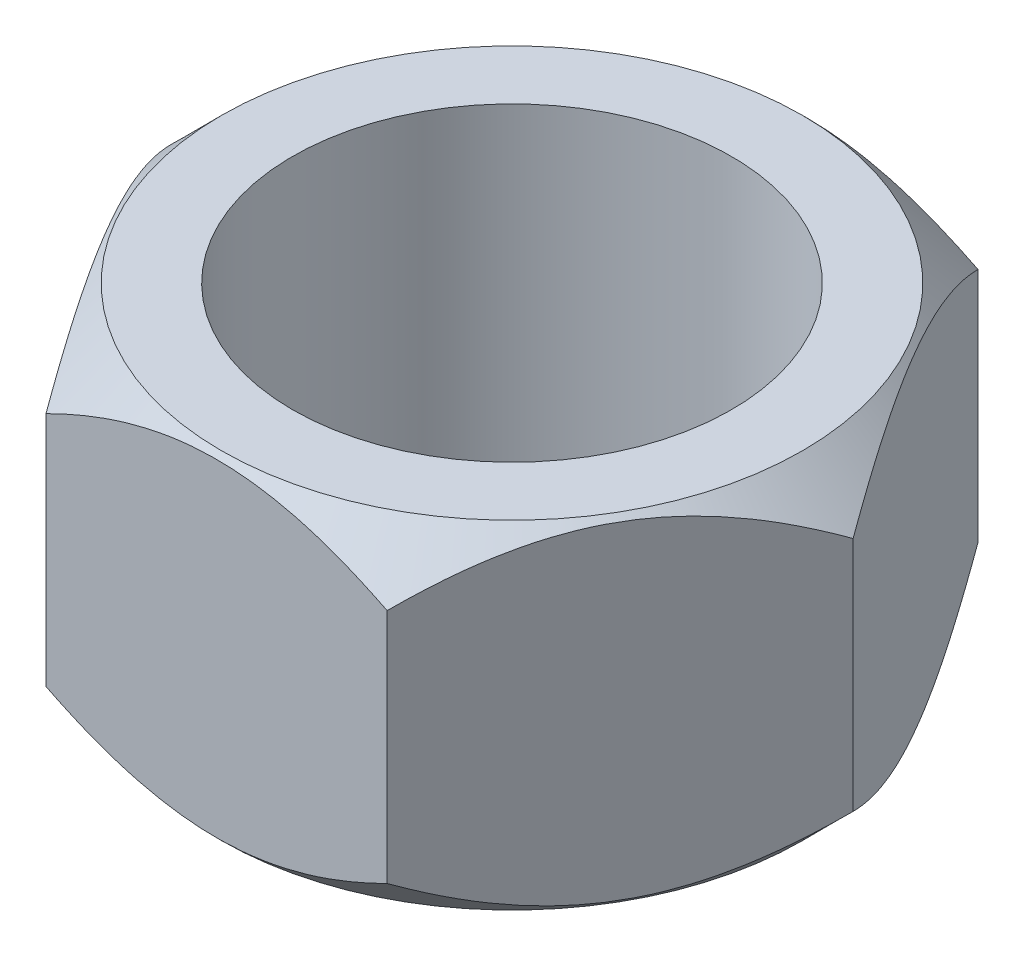
ISO-10303-21;
HEADER;
FILE_DESCRIPTION(('STEP AP214'),'2;1');
FILE_NAME('part.step','',(''),(''),'','','');
FILE_SCHEMA(('AUTOMOTIVE_DESIGN { 1 0 10303 214 1 1 1 1 }'));
ENDSEC;
DATA;
#1=APPLICATION_CONTEXT('core data for automotive mechanical design processes');
#2=APPLICATION_PROTOCOL_DEFINITION('international standard','automotive_design',2000,#1);
#3=PRODUCT_CONTEXT('',#1,'mechanical');
#4=PRODUCT('Part','Part','',(#3));
#5=PRODUCT_RELATED_PRODUCT_CATEGORY('part','',(#4));
#6=PRODUCT_DEFINITION_FORMATION('','',#4);
#7=PRODUCT_DEFINITION_CONTEXT('part definition',#1,'design');
#8=PRODUCT_DEFINITION('design','',#6,#7);
#9=PRODUCT_DEFINITION_SHAPE('','',#8);
#10=(LENGTH_UNIT() NAMED_UNIT(*) SI_UNIT(.MILLI.,.METRE.));
#11=(NAMED_UNIT(*) PLANE_ANGLE_UNIT() SI_UNIT($,.RADIAN.));
#12=(NAMED_UNIT(*) SI_UNIT($,.STERADIAN.) SOLID_ANGLE_UNIT());
#13=UNCERTAINTY_MEASURE_WITH_UNIT(LENGTH_MEASURE(1.E-05),#10,'distance_accuracy_value','');
#14=(GEOMETRIC_REPRESENTATION_CONTEXT(3) GLOBAL_UNCERTAINTY_ASSIGNED_CONTEXT((#13)) GLOBAL_UNIT_ASSIGNED_CONTEXT((#10,
#11,#12)) REPRESENTATION_CONTEXT('',''));
#15=CARTESIAN_POINT('',(0.,0.,0.));
#16=DIRECTION('',(0.,0.,1.));
#17=DIRECTION('',(1.,0.,0.));
#18=AXIS2_PLACEMENT_3D('',#15,#16,#17);
#19=CARTESIAN_POINT('',(0.,0.2,0.));
#20=DIRECTION('',(0.,1.,0.));
#21=DIRECTION('',(0.,0.,1.));
#22=AXIS2_PLACEMENT_3D('',#19,#20,#21);
#23=PLANE('',#22);
#24=CARTESIAN_POINT('',(0.,0.2,0.));
#25=DIRECTION('',(0.,1.,0.));
#26=DIRECTION('',(0.,0.,1.));
#27=AXIS2_PLACEMENT_3D('',#24,#25,#26);
#28=CIRCLE('',#27,0.13);
#29=CARTESIAN_POINT('',(0.,0.2,0.13));
#30=VERTEX_POINT('',#29);
#31=EDGE_CURVE('E126',#30,#30,#28,.T.);
#32=ORIENTED_EDGE('',*,*,#31,.F.);
#33=EDGE_LOOP('',(#32));
#34=FACE_BOUND('',#33,.T.);
#35=CARTESIAN_POINT('',(0.,0.2,0.));
#36=DIRECTION('',(0.,-1.,0.));
#37=DIRECTION('',(0.,0.,-1.));
#38=AXIS2_PLACEMENT_3D('',#35,#36,#37);
#39=CIRCLE('',#38,0.172072594216369);
#40=CARTESIAN_POINT('',(0.,0.2,-0.172072594216369));
#41=VERTEX_POINT('',#40);
#42=EDGE_CURVE('E222',#41,#41,#39,.T.);
#43=ORIENTED_EDGE('',*,*,#42,.F.);
#44=EDGE_LOOP('',(#43));
#45=FACE_BOUND('',#44,.T.);
#46=ADVANCED_FACE('F39',(#34,#45),#23,.T.);
#47=CARTESIAN_POINT('',(0.,0.,0.));
#48=DIRECTION('',(0.,1.,0.));
#49=DIRECTION('',(0.,0.,1.));
#50=AXIS2_PLACEMENT_3D('',#47,#48,#49);
#51=PLANE('',#50);
#52=CARTESIAN_POINT('',(0.,0.,0.));
#53=DIRECTION('',(0.,1.,0.));
#54=DIRECTION('',(0.,0.,1.));
#55=AXIS2_PLACEMENT_3D('',#52,#53,#54);
#56=CIRCLE('',#55,0.13);
#57=CARTESIAN_POINT('',(0.,0.,0.13));
#58=VERTEX_POINT('',#57);
#59=EDGE_CURVE('E123',#58,#58,#56,.F.);
#60=ORIENTED_EDGE('',*,*,#59,.F.);
#61=EDGE_LOOP('',(#60));
#62=FACE_BOUND('',#61,.T.);
#63=CARTESIAN_POINT('',(0.,0.,0.));
#64=DIRECTION('',(0.,-1.,0.));
#65=DIRECTION('',(0.,0.,-1.));
#66=AXIS2_PLACEMENT_3D('',#63,#64,#65);
#67=CIRCLE('',#66,0.172072594216369);
#68=CARTESIAN_POINT('',(0.,0.,-0.172072594216369));
#69=VERTEX_POINT('',#68);
#70=EDGE_CURVE('E219',#69,#69,#67,.T.);
#71=ORIENTED_EDGE('',*,*,#70,.T.);
#72=EDGE_LOOP('',(#71));
#73=FACE_BOUND('',#72,.T.);
#74=ADVANCED_FACE('F237',(#62,#73),#51,.F.);
#75=CARTESIAN_POINT('',(0.,-0.000999999999999997,0.));
#76=DIRECTION('',(0.,1.,0.));
#77=DIRECTION('',(0.,0.,1.));
#78=AXIS2_PLACEMENT_3D('',#75,#76,#77);
#79=CYLINDRICAL_SURFACE('',#78,0.13);
#80=ORIENTED_EDGE('',*,*,#31,.T.);
#81=EDGE_LOOP('',(#80));
#82=FACE_BOUND('',#81,.T.);
#83=ORIENTED_EDGE('',*,*,#59,.T.);
#84=EDGE_LOOP('',(#83));
#85=FACE_BOUND('',#84,.T.);
#86=ADVANCED_FACE('F151',(#82,#85),#79,.F.);
#87=CARTESIAN_POINT('',(0.,0.03,0.));
#88=DIRECTION('',(0.,1.,0.));
#89=DIRECTION('',(0.,0.,1.));
#90=AXIS2_PLACEMENT_3D('',#87,#88,#89);
#91=CONICAL_SURFACE('',#90,0.202072594216369,0.785398163397448);
#92=ORIENTED_EDGE('',*,*,#70,.F.);
#93=EDGE_LOOP('',(#92));
#94=FACE_BOUND('',#93,.T.);
#95=CARTESIAN_POINT('',(-0.305523676388778,0.180020741185078,0.175000000000003));
#96=CARTESIAN_POINT('',(-0.296489908838127,0.172183831382914,0.175000000000003));
#97=CARTESIAN_POINT('',(-0.287415146295133,0.164392967909618,0.175000000000003));
#98=CARTESIAN_POINT('',(-0.269154387743841,0.148934007099864,0.175000000000003));
#99=CARTESIAN_POINT('',(-0.259968341025767,0.141265969735403,0.175000000000003));
#100=CARTESIAN_POINT('',(-0.231792912014465,0.118159352301111,0.175000000000002));
#101=CARTESIAN_POINT('',(-0.212593498149153,0.102976933592517,0.175000000000002));
#102=CARTESIAN_POINT('',(-0.173225826261023,0.0737968112831864,0.175000000000002));
#103=CARTESIAN_POINT('',(-0.153056247455226,0.0598007987664813,0.175000000000002));
#104=CARTESIAN_POINT('',(-0.121625871967722,0.0408846564593255,0.175000000000001));
#105=CARTESIAN_POINT('',(-0.110992522327468,0.0349428850748385,0.175000000000001));
#106=CARTESIAN_POINT('',(-0.0892065324424278,0.0241236116347812,0.175000000000001));
#107=CARTESIAN_POINT('',(-0.0780548914239576,0.019244157012983,0.175000000000001));
#108=CARTESIAN_POINT('',(-0.054889353290563,0.0110090414325916,0.175000000000001));
#109=CARTESIAN_POINT('',(-0.042861810598884,0.00768961095311468,0.175));
#110=CARTESIAN_POINT('',(-0.0184374809922947,0.00349261265701018,0.175));
#111=CARTESIAN_POINT('',(-0.00604375843554487,0.00259860561394281,0.175));
#112=CARTESIAN_POINT('',(0.0186589035579463,0.00348347437230432,0.175));
#113=CARTESIAN_POINT('',(0.0309676778388264,0.00526658114702027,0.175));
#114=CARTESIAN_POINT('',(0.055121835537638,0.0110204288976895,0.174999999999999));
#115=CARTESIAN_POINT('',(0.066962891236474,0.0150080075104535,0.174999999999999));
#116=CARTESIAN_POINT('',(0.0925903967170636,0.0254913127781551,0.174999999999999));
#117=CARTESIAN_POINT('',(0.106222397963112,0.0323479327338906,0.174999999999999));
#118=CARTESIAN_POINT('',(0.132785083008031,0.0473282769905635,0.174999999999999));
#119=CARTESIAN_POINT('',(0.145713884757198,0.0554551958902634,0.174999999999998));
#120=CARTESIAN_POINT('',(0.171116757407903,0.0725030550642843,0.174999999999998));
#121=CARTESIAN_POINT('',(0.183588422373839,0.0814275266529352,0.174999999999998));
#122=CARTESIAN_POINT('',(0.208171534529215,0.0997613344596472,0.174999999999998));
#123=CARTESIAN_POINT('',(0.220282872493368,0.109170815382806,0.174999999999998));
#124=CARTESIAN_POINT('',(0.244773267048624,0.128729600372015,0.174999999999997));
#125=CARTESIAN_POINT('',(0.257140782569694,0.138893253718197,0.174999999999997));
#126=CARTESIAN_POINT('',(0.281533947754556,0.15935584068324,0.174999999999997));
#127=CARTESIAN_POINT('',(0.293561858362563,0.169652072271718,0.174999999999997));
#128=CARTESIAN_POINT('',(0.305523676388796,0.180020741185059,0.174999999999997));
#129=B_SPLINE_CURVE_WITH_KNOTS('',3,(#95,#96,#97,#98,#99,#100,#101,#102,#103,#104,#105,#106,
#107,#108,#109,#110,#111,#112,#113,#114,#115,#116,#117,#118,#119,#120,#121,#122,#123,#124,#125,
#126,#127,#128),.UNSPECIFIED.,.F.,.F.,(4,2,2,2,2,2,2,2,2,2,2,2,2,2,2,2,4),(0.,
0.0358791858717531,0.0717753868661952,0.145194810618015,0.218717184603454,0.255222439137126,
0.291660018720837,0.328906459590413,0.365899810358559,0.402951687859047,0.440290555644729,
0.485949579311969,0.531725332469436,0.577714888588238,0.623718246264905,0.671738421373987,
0.71923249865855),.UNSPECIFIED.);
#130=CARTESIAN_POINT('',(-0.101036297108183,0.03,0.175000000000001));
#131=VERTEX_POINT('',#130);
#132=CARTESIAN_POINT('',(0.101036297108187,0.03,0.174999999999999));
#133=VERTEX_POINT('',#132);
#134=EDGE_CURVE('E216',#131,#133,#129,.T.);
#135=ORIENTED_EDGE('',*,*,#134,.F.);
#136=CARTESIAN_POINT('',(-0.202188064270207,0.0301155689716211,-0.000199999999998585));
#137=CARTESIAN_POINT('',(-0.198703631032227,0.0266353582002987,0.00583521540376361));
#138=CARTESIAN_POINT('',(-0.19516812884351,0.0233561607693212,0.0119588848248932));
#139=CARTESIAN_POINT('',(-0.187958416249236,0.0173509339832806,0.024446473346144));
#140=CARTESIAN_POINT('',(-0.184283514126903,0.0146282605899538,0.030811590534868));
#141=CARTESIAN_POINT('',(-0.173197940686131,0.00767257771140506,0.0500123669653207));
#142=CARTESIAN_POINT('',(-0.165595169610615,0.00450719433873056,0.0631807527464294));
#143=CARTESIAN_POINT('',(-0.152438981682354,0.00259198694259939,0.0859679386721011));
#144=CARTESIAN_POINT('',(-0.146921716381356,0.00283778648731017,0.0955241224922663));
#145=CARTESIAN_POINT('',(-0.135999962652701,0.0053380333682639,0.114441154858052));
#146=CARTESIAN_POINT('',(-0.130595655856693,0.00759549393812453,0.123801688808426));
#147=CARTESIAN_POINT('',(-0.121088664876771,0.0130527175286838,0.140268280212751));
#148=CARTESIAN_POINT('',(-0.1169428139788,0.0159716193201152,0.14744910460864));
#149=CARTESIAN_POINT('',(-0.108814120659484,0.0225492282802671,0.161528414436842));
#150=CARTESIAN_POINT('',(-0.104830798271256,0.0262055337725978,0.168427731196179));
#151=CARTESIAN_POINT('',(-0.100920827054125,0.0301155689700877,0.175200000000383));
#152=B_SPLINE_CURVE_WITH_KNOTS('',3,(#136,#137,#138,#139,#140,#141,#142,#143,#144,#145,#146,
#147,#148,#149,#150,#151),.UNSPECIFIED.,.F.,.F.,(4,2,2,2,2,2,2,4),(0.,0.0233618368538911,
0.046860644775359,0.0929709001337304,0.125885794260102,0.158850074087303,0.185183994279812,
0.211433492833065),.UNSPECIFIED.);
#153=CARTESIAN_POINT('',(-0.202072594216369,0.03,0.));
#154=VERTEX_POINT('',#153);
#155=EDGE_CURVE('E218',#154,#131,#152,.T.);
#156=ORIENTED_EDGE('',*,*,#155,.F.);
#157=CARTESIAN_POINT('',(-0.100920827054347,0.0301155689716211,-0.1752));
#158=CARTESIAN_POINT('',(-0.104405260292327,0.0266353582002988,-0.169164784596237));
#159=CARTESIAN_POINT('',(-0.107940762481044,0.0233561607693213,-0.163041115175108));
#160=CARTESIAN_POINT('',(-0.115150475075318,0.0173509339832807,-0.150553526653857));
#161=CARTESIAN_POINT('',(-0.118825377197651,0.0146282605899538,-0.144188409465133));
#162=CARTESIAN_POINT('',(-0.129910950638423,0.00767257771140508,-0.12498763303468));
#163=CARTESIAN_POINT('',(-0.137513721713939,0.00450719433873059,-0.111819247253571));
#164=CARTESIAN_POINT('',(-0.150669909642199,0.00259198694259939,-0.0890320613278992));
#165=CARTESIAN_POINT('',(-0.156187174943197,0.00283778648731015,-0.0794758775077339));
#166=CARTESIAN_POINT('',(-0.167108928671852,0.00533803336826387,-0.0605588451419479));
#167=CARTESIAN_POINT('',(-0.172513235467859,0.00759549393812453,-0.0511983111915738));
#168=CARTESIAN_POINT('',(-0.182020226447782,0.0130527175286838,-0.0347317197872485));
#169=CARTESIAN_POINT('',(-0.186166077345752,0.0159716193201152,-0.0275508953913593));
#170=CARTESIAN_POINT('',(-0.194294770665068,0.022549228280267,-0.0134715855631578));
#171=CARTESIAN_POINT('',(-0.198278093053296,0.0262055337725977,-0.00657226880382017));
#172=CARTESIAN_POINT('',(-0.202188064270427,0.0301155689700877,0.000200000000382929));
#173=B_SPLINE_CURVE_WITH_KNOTS('',3,(#157,#158,#159,#160,#161,#162,#163,#164,#165,#166,#167,
#168,#169,#170,#171,#172),.UNSPECIFIED.,.F.,.F.,(4,2,2,2,2,2,2,4),(0.,0.0233618368538911,
0.046860644775359,0.0929709001337304,0.125885794260102,0.158850074087303,0.185183994279812,
0.211433492833065),.UNSPECIFIED.);
#174=CARTESIAN_POINT('',(-0.101036297108185,0.03,-0.175));
#175=VERTEX_POINT('',#174);
#176=EDGE_CURVE('E96',#175,#154,#173,.T.);
#177=ORIENTED_EDGE('',*,*,#176,.F.);
#178=CARTESIAN_POINT('',(0.305523676388779,0.180020741185078,-0.175000000000001));
#179=CARTESIAN_POINT('',(0.296489908838128,0.172183831382914,-0.175000000000001));
#180=CARTESIAN_POINT('',(0.287415146295134,0.164392967909618,-0.175000000000001));
#181=CARTESIAN_POINT('',(0.269154387743842,0.148934007099864,-0.175000000000001));
#182=CARTESIAN_POINT('',(0.259968341025768,0.141265969735403,-0.175000000000001));
#183=CARTESIAN_POINT('',(0.231792912014466,0.118159352301111,-0.175000000000001));
#184=CARTESIAN_POINT('',(0.212593498149154,0.102976933592517,-0.175000000000001));
#185=CARTESIAN_POINT('',(0.173225826261024,0.0737968112831865,-0.175000000000001));
#186=CARTESIAN_POINT('',(0.153056247455228,0.0598007987664814,-0.175000000000001));
#187=CARTESIAN_POINT('',(0.121625871967723,0.0408846564593256,-0.175));
#188=CARTESIAN_POINT('',(0.11099252232747,0.0349428850748386,-0.175));
#189=CARTESIAN_POINT('',(0.0892065324424291,0.0241236116347812,-0.175));
#190=CARTESIAN_POINT('',(0.078054891423959,0.019244157012983,-0.175));
#191=CARTESIAN_POINT('',(0.0548893532905643,0.0110090414325917,-0.175));
#192=CARTESIAN_POINT('',(0.0428618105988854,0.00768961095311474,-0.175));
#193=CARTESIAN_POINT('',(0.0184374809922961,0.0034926126570102,-0.175));
#194=CARTESIAN_POINT('',(0.00604375843554623,0.00259860561394282,-0.175));
#195=CARTESIAN_POINT('',(-0.0186589035579449,0.00348347437230432,-0.175));
#196=CARTESIAN_POINT('',(-0.0309676778388251,0.00526658114702029,-0.175));
#197=CARTESIAN_POINT('',(-0.0551218355376367,0.0110204288976895,-0.175));
#198=CARTESIAN_POINT('',(-0.0669628912364727,0.0150080075104535,-0.175));
#199=CARTESIAN_POINT('',(-0.0925903967170623,0.025491312778155,-0.175));
#200=CARTESIAN_POINT('',(-0.106222397963111,0.0323479327338906,-0.175));
#201=CARTESIAN_POINT('',(-0.13278508300803,0.0473282769905634,-0.175));
#202=CARTESIAN_POINT('',(-0.145713884757196,0.0554551958902633,-0.175));
#203=CARTESIAN_POINT('',(-0.171116757407902,0.0725030550642841,-0.174999999999999));
#204=CARTESIAN_POINT('',(-0.183588422373837,0.081427526652935,-0.174999999999999));
#205=CARTESIAN_POINT('',(-0.208171534529214,0.099761334459647,-0.174999999999999));
#206=CARTESIAN_POINT('',(-0.220282872493366,0.109170815382805,-0.174999999999999));
#207=CARTESIAN_POINT('',(-0.244773267048623,0.128729600372015,-0.174999999999999));
#208=CARTESIAN_POINT('',(-0.257140782569693,0.138893253718197,-0.174999999999999));
#209=CARTESIAN_POINT('',(-0.281533947754555,0.15935584068324,-0.174999999999999));
#210=CARTESIAN_POINT('',(-0.293561858362562,0.169652072271718,-0.174999999999999));
#211=CARTESIAN_POINT('',(-0.305523676388795,0.180020741185059,-0.174999999999999));
#212=B_SPLINE_CURVE_WITH_KNOTS('',3,(#178,#179,#180,#181,#182,#183,#184,#185,#186,#187,#188,
#189,#190,#191,#192,#193,#194,#195,#196,#197,#198,#199,#200,#201,#202,#203,#204,#205,#206,#207,
#208,#209,#210,#211),.UNSPECIFIED.,.F.,.F.,(4,2,2,2,2,2,2,2,2,2,2,2,2,2,2,2,4),(0.,
0.0358791858717531,0.0717753868661952,0.145194810618015,0.218717184603454,0.255222439137126,
0.291660018720837,0.328906459590413,0.365899810358559,0.402951687859047,0.440290555644729,
0.485949579311969,0.531725332469436,0.577714888588237,0.623718246264905,0.671738421373987,
0.71923249865855),.UNSPECIFIED.);
#213=CARTESIAN_POINT('',(0.101036297108184,0.03,-0.175));
#214=VERTEX_POINT('',#213);
#215=EDGE_CURVE('E91',#214,#175,#212,.T.);
#216=ORIENTED_EDGE('',*,*,#215,.F.);
#217=CARTESIAN_POINT('',(0.202188064270207,0.0301155689716211,0.000199999999999997));
#218=CARTESIAN_POINT('',(0.198703631032228,0.0266353582002988,-0.00583521540376223));
#219=CARTESIAN_POINT('',(0.19516812884351,0.0233561607693213,-0.0119588848248919));
#220=CARTESIAN_POINT('',(0.187958416249237,0.0173509339832807,-0.0244464733461427));
#221=CARTESIAN_POINT('',(0.184283514126903,0.0146282605899538,-0.0308115905348667));
#222=CARTESIAN_POINT('',(0.173197940686131,0.00767257771140509,-0.0500123669653195));
#223=CARTESIAN_POINT('',(0.165595169610615,0.00450719433873059,-0.0631807527464283));
#224=CARTESIAN_POINT('',(0.152438981682355,0.00259198694259941,-0.0859679386721001));
#225=CARTESIAN_POINT('',(0.146921716381357,0.00283778648731019,-0.0955241224922654));
#226=CARTESIAN_POINT('',(0.135999962652701,0.00533803336826392,-0.114441154858051));
#227=CARTESIAN_POINT('',(0.130595655856694,0.00759549393812455,-0.123801688808425));
#228=CARTESIAN_POINT('',(0.121088664876772,0.0130527175286838,-0.140268280212751));
#229=CARTESIAN_POINT('',(0.116942813978802,0.0159716193201152,-0.14744910460864));
#230=CARTESIAN_POINT('',(0.108814120659485,0.022549228280267,-0.161528414436841));
#231=CARTESIAN_POINT('',(0.104830798271257,0.0262055337725977,-0.168427731196179));
#232=CARTESIAN_POINT('',(0.100920827054126,0.0301155689700877,-0.175200000000382));
#233=B_SPLINE_CURVE_WITH_KNOTS('',3,(#217,#218,#219,#220,#221,#222,#223,#224,#225,#226,#227,
#228,#229,#230,#231,#232),.UNSPECIFIED.,.F.,.F.,(4,2,2,2,2,2,2,4),(0.,0.0233618368538911,
0.046860644775359,0.0929709001337304,0.125885794260102,0.158850074087303,0.185183994279812,
0.211433492833065),.UNSPECIFIED.);
#234=CARTESIAN_POINT('',(0.202072594216369,0.03,0.));
#235=VERTEX_POINT('',#234);
#236=EDGE_CURVE('E94',#235,#214,#233,.T.);
#237=ORIENTED_EDGE('',*,*,#236,.F.);
#238=CARTESIAN_POINT('',(0.100920827054349,0.0301155689716211,0.175199999999999));
#239=CARTESIAN_POINT('',(0.104405260292328,0.0266353582002988,0.169164784596237));
#240=CARTESIAN_POINT('',(0.107940762481046,0.0233561607693214,0.163041115175107));
#241=CARTESIAN_POINT('',(0.115150475075319,0.0173509339832809,0.150553526653856));
#242=CARTESIAN_POINT('',(0.118825377197652,0.0146282605899541,0.144188409465132));
#243=CARTESIAN_POINT('',(0.129910950638424,0.00767257771140561,0.12498763303468));
#244=CARTESIAN_POINT('',(0.137513721713939,0.00450719433873121,0.111819247253571));
#245=CARTESIAN_POINT('',(0.1506699096422,0.00259198694260008,0.0890320613278993));
#246=CARTESIAN_POINT('',(0.156187174943198,0.00283778648731087,0.0794758775077339));
#247=CARTESIAN_POINT('',(0.167108928671853,0.00533803336826466,0.0605588451419478));
#248=CARTESIAN_POINT('',(0.17251323546786,0.00759549393812535,0.0511983111915737));
#249=CARTESIAN_POINT('',(0.182020226447783,0.0130527175286845,0.0347317197872487));
#250=CARTESIAN_POINT('',(0.186166077345753,0.0159716193201158,0.0275508953913598));
#251=CARTESIAN_POINT('',(0.194294770665068,0.0225492282802674,0.0134715855631588));
#252=CARTESIAN_POINT('',(0.198278093053296,0.0262055337725979,0.00657226880382133));
#253=CARTESIAN_POINT('',(0.202188064270427,0.0301155689700877,-0.000200000000381526));
#254=B_SPLINE_CURVE_WITH_KNOTS('',3,(#238,#239,#240,#241,#242,#243,#244,#245,#246,#247,#248,
#249,#250,#251,#252,#253),.UNSPECIFIED.,.F.,.F.,(4,2,2,2,2,2,2,4),(0.,0.0233618368538909,
0.0468606447753585,0.0929709001337293,0.125885794260101,0.158850074087302,0.18518399427981,
0.211433492833062),.UNSPECIFIED.);
#255=EDGE_CURVE('E63',#133,#235,#254,.T.);
#256=ORIENTED_EDGE('',*,*,#255,.F.);
#257=EDGE_LOOP('',(#135,#156,#177,#216,#237,#256));
#258=FACE_BOUND('',#257,.T.);
#259=ADVANCED_FACE('F93',(#94,#258),#91,.T.);
#260=CARTESIAN_POINT('',(0.,0.2,0.));
#261=DIRECTION('',(0.,-1.,0.));
#262=DIRECTION('',(0.,0.,-1.));
#263=AXIS2_PLACEMENT_3D('',#260,#261,#262);
#264=CONICAL_SURFACE('',#263,0.172072594216369,0.785398163397448);
#265=ORIENTED_EDGE('',*,*,#42,.T.);
#266=EDGE_LOOP('',(#265));
#267=FACE_BOUND('',#266,.T.);
#268=CARTESIAN_POINT('',(0.100920827054346,0.169884431028379,-0.1752));
#269=CARTESIAN_POINT('',(0.104405260292326,0.173364641799701,-0.169164784596238));
#270=CARTESIAN_POINT('',(0.107940762481043,0.176643839230679,-0.163041115175108));
#271=CARTESIAN_POINT('',(0.115150475075317,0.182649066016719,-0.150553526653858));
#272=CARTESIAN_POINT('',(0.11882537719765,0.185371739410046,-0.144188409465134));
#273=CARTESIAN_POINT('',(0.129910950638422,0.192327422288595,-0.124987633034681));
#274=CARTESIAN_POINT('',(0.137513721713938,0.195492805661269,-0.111819247253572));
#275=CARTESIAN_POINT('',(0.150669909642199,0.197408013057401,-0.0890320613279003));
#276=CARTESIAN_POINT('',(0.156187174943197,0.19716221351269,-0.079475877507735));
#277=CARTESIAN_POINT('',(0.167108928671852,0.194661966631736,-0.0605588451419491));
#278=CARTESIAN_POINT('',(0.172513235467859,0.192404506061875,-0.051198311191575));
#279=CARTESIAN_POINT('',(0.182020226447782,0.186947282471316,-0.0347317197872498));
#280=CARTESIAN_POINT('',(0.186166077345752,0.184028380679885,-0.0275508953913607));
#281=CARTESIAN_POINT('',(0.194294770665068,0.177450771719733,-0.0134715855631592));
#282=CARTESIAN_POINT('',(0.198278093053296,0.173794466227402,-0.00657226880382156));
#283=CARTESIAN_POINT('',(0.202188064270427,0.169884431029912,0.000200000000381509));
#284=B_SPLINE_CURVE_WITH_KNOTS('',3,(#268,#269,#270,#271,#272,#273,#274,#275,#276,#277,#278,
#279,#280,#281,#282,#283),.UNSPECIFIED.,.F.,.F.,(4,2,2,2,2,2,2,4),(0.,0.0233618368538911,
0.0468606447753589,0.0929709001337304,0.125885794260102,0.158850074087303,0.185183994279812,
0.211433492833065),.UNSPECIFIED.);
#285=CARTESIAN_POINT('',(0.101036297108184,0.17,-0.175));
#286=VERTEX_POINT('',#285);
#287=CARTESIAN_POINT('',(0.202072594216369,0.17,0.));
#288=VERTEX_POINT('',#287);
#289=EDGE_CURVE('E137',#286,#288,#284,.T.);
#290=ORIENTED_EDGE('',*,*,#289,.F.);
#291=CARTESIAN_POINT('',(-0.30552367638878,0.0199792588149224,-0.174999999999999));
#292=CARTESIAN_POINT('',(-0.296489908838129,0.0278161686170864,-0.174999999999999));
#293=CARTESIAN_POINT('',(-0.287415146295135,0.0356070320903817,-0.174999999999999));
#294=CARTESIAN_POINT('',(-0.269154387743843,0.0510659929001364,-0.174999999999999));
#295=CARTESIAN_POINT('',(-0.259968341025769,0.0587340302645967,-0.174999999999999));
#296=CARTESIAN_POINT('',(-0.231792912014468,0.0818406476988887,-0.174999999999999));
#297=CARTESIAN_POINT('',(-0.212593498149155,0.097023066407483,-0.174999999999999));
#298=CARTESIAN_POINT('',(-0.173225826261026,0.126203188716814,-0.174999999999999));
#299=CARTESIAN_POINT('',(-0.153056247455229,0.140199201233519,-0.174999999999999));
#300=CARTESIAN_POINT('',(-0.121625871967724,0.159115343540674,-0.175));
#301=CARTESIAN_POINT('',(-0.110992522327471,0.165057114925161,-0.175));
#302=CARTESIAN_POINT('',(-0.0892065324424303,0.175876388365219,-0.175));
#303=CARTESIAN_POINT('',(-0.0780548914239601,0.180755842987017,-0.175));
#304=CARTESIAN_POINT('',(-0.0548893532905655,0.188990958567408,-0.175));
#305=CARTESIAN_POINT('',(-0.0428618105988865,0.192310389046885,-0.175));
#306=CARTESIAN_POINT('',(-0.0184374809922972,0.19650738734299,-0.175));
#307=CARTESIAN_POINT('',(-0.00604375843554739,0.197401394386057,-0.175));
#308=CARTESIAN_POINT('',(0.0186589035579438,0.196516525627696,-0.175));
#309=CARTESIAN_POINT('',(0.0309676778388239,0.19473341885298,-0.175));
#310=CARTESIAN_POINT('',(0.0551218355376355,0.188979571102311,-0.175));
#311=CARTESIAN_POINT('',(0.0669628912364715,0.184991992489547,-0.175));
#312=CARTESIAN_POINT('',(0.0925903967170611,0.174508687221845,-0.175));
#313=CARTESIAN_POINT('',(0.106222397963109,0.167652067266109,-0.175));
#314=CARTESIAN_POINT('',(0.132785083008029,0.152671723009437,-0.175));
#315=CARTESIAN_POINT('',(0.145713884757195,0.144544804109737,-0.175));
#316=CARTESIAN_POINT('',(0.171116757407901,0.127496944935716,-0.175000000000001));
#317=CARTESIAN_POINT('',(0.183588422373836,0.118572473347065,-0.175000000000001));
#318=CARTESIAN_POINT('',(0.208171534529213,0.100238665540353,-0.175000000000001));
#319=CARTESIAN_POINT('',(0.220282872493365,0.0908291846171945,-0.175000000000001));
#320=CARTESIAN_POINT('',(0.244773267048621,0.0712703996279851,-0.175000000000001));
#321=CARTESIAN_POINT('',(0.257140782569692,0.0611067462818031,-0.175000000000001));
#322=CARTESIAN_POINT('',(0.281533947754554,0.0406441593167597,-0.175000000000001));
#323=CARTESIAN_POINT('',(0.293561858362561,0.0303479277282825,-0.175000000000001));
#324=CARTESIAN_POINT('',(0.305523676388794,0.0199792588149411,-0.175000000000001));
#325=B_SPLINE_CURVE_WITH_KNOTS('',3,(#291,#292,#293,#294,#295,#296,#297,#298,#299,#300,#301,
#302,#303,#304,#305,#306,#307,#308,#309,#310,#311,#312,#313,#314,#315,#316,#317,#318,#319,#320,
#321,#322,#323,#324),.UNSPECIFIED.,.F.,.F.,(4,2,2,2,2,2,2,2,2,2,2,2,2,2,2,2,4),(0.,
0.0358791858717531,0.0717753868661951,0.145194810618015,0.218717184603454,0.255222439137126,
0.291660018720837,0.328906459590413,0.365899810358559,0.402951687859047,0.440290555644729,
0.485949579311969,0.531725332469436,0.577714888588238,0.623718246264905,0.671738421373987,
0.71923249865855),.UNSPECIFIED.);
#326=CARTESIAN_POINT('',(-0.101036297108185,0.17,-0.175));
#327=VERTEX_POINT('',#326);
#328=EDGE_CURVE('E110',#327,#286,#325,.T.);
#329=ORIENTED_EDGE('',*,*,#328,.F.);
#330=CARTESIAN_POINT('',(-0.202188064270207,0.169884431028379,0.000200000000001411));
#331=CARTESIAN_POINT('',(-0.198703631032228,0.173364641799701,-0.00583521540376082));
#332=CARTESIAN_POINT('',(-0.19516812884351,0.176643839230679,-0.0119588848248905));
#333=CARTESIAN_POINT('',(-0.187958416249237,0.182649066016719,-0.0244464733461414));
#334=CARTESIAN_POINT('',(-0.184283514126903,0.185371739410046,-0.0308115905348654));
#335=CARTESIAN_POINT('',(-0.173197940686132,0.192327422288595,-0.0500123669653183));
#336=CARTESIAN_POINT('',(-0.165595169610616,0.195492805661269,-0.0631807527464271));
#337=CARTESIAN_POINT('',(-0.152438981682355,0.197408013057401,-0.0859679386720989));
#338=CARTESIAN_POINT('',(-0.146921716381358,0.19716221351269,-0.0955241224922642));
#339=CARTESIAN_POINT('',(-0.135999962652702,0.194661966631736,-0.11444115485805));
#340=CARTESIAN_POINT('',(-0.130595655856695,0.192404506061875,-0.123801688808424));
#341=CARTESIAN_POINT('',(-0.121088664876773,0.186947282471316,-0.14026828021275));
#342=CARTESIAN_POINT('',(-0.116942813978803,0.184028380679885,-0.147449104608639));
#343=CARTESIAN_POINT('',(-0.108814120659486,0.177450771719733,-0.16152841443684));
#344=CARTESIAN_POINT('',(-0.104830798271258,0.173794466227402,-0.168427731196178));
#345=CARTESIAN_POINT('',(-0.100920827054127,0.169884431029912,-0.175200000000381));
#346=B_SPLINE_CURVE_WITH_KNOTS('',3,(#330,#331,#332,#333,#334,#335,#336,#337,#338,#339,#340,
#341,#342,#343,#344,#345),.UNSPECIFIED.,.F.,.F.,(4,2,2,2,2,2,2,4),(0.,0.0233618368538911,
0.046860644775359,0.0929709001337303,0.125885794260102,0.158850074087303,0.185183994279812,
0.211433492833065),.UNSPECIFIED.);
#347=CARTESIAN_POINT('',(-0.202072594216369,0.17,0.));
#348=VERTEX_POINT('',#347);
#349=EDGE_CURVE('E173',#348,#327,#346,.T.);
#350=ORIENTED_EDGE('',*,*,#349,.F.);
#351=CARTESIAN_POINT('',(-0.100920827054345,0.169884431028379,0.175200000000001));
#352=CARTESIAN_POINT('',(-0.104405260292325,0.173364641799701,0.169164784596239));
#353=CARTESIAN_POINT('',(-0.107940762481042,0.176643839230679,0.163041115175109));
#354=CARTESIAN_POINT('',(-0.115150475075316,0.182649066016719,0.150553526653858));
#355=CARTESIAN_POINT('',(-0.118825377197649,0.185371739410046,0.144188409465134));
#356=CARTESIAN_POINT('',(-0.129910950638421,0.192327422288595,0.124987633034682));
#357=CARTESIAN_POINT('',(-0.137513721713937,0.195492805661269,0.111819247253573));
#358=CARTESIAN_POINT('',(-0.150669909642198,0.197408013057401,0.0890320613279013));
#359=CARTESIAN_POINT('',(-0.156187174943196,0.19716221351269,0.079475877507736));
#360=CARTESIAN_POINT('',(-0.167108928671851,0.194661966631736,0.0605588451419502));
#361=CARTESIAN_POINT('',(-0.172513235467859,0.192404506061875,0.0511983111915762));
#362=CARTESIAN_POINT('',(-0.182020226447782,0.186947282471316,0.034731719787251));
#363=CARTESIAN_POINT('',(-0.186166077345752,0.184028380679885,0.0275508953913619));
#364=CARTESIAN_POINT('',(-0.194294770665068,0.177450771719733,0.0134715855631605));
#365=CARTESIAN_POINT('',(-0.198278093053296,0.173794466227402,0.00657226880382294));
#366=CARTESIAN_POINT('',(-0.202188064270427,0.169884431029912,-0.000200000000380089));
#367=B_SPLINE_CURVE_WITH_KNOTS('',3,(#351,#352,#353,#354,#355,#356,#357,#358,#359,#360,#361,
#362,#363,#364,#365,#366),.UNSPECIFIED.,.F.,.F.,(4,2,2,2,2,2,2,4),(0.,0.0233618368538912,
0.046860644775359,0.0929709001337305,0.125885794260102,0.158850074087303,0.185183994279812,
0.211433492833065),.UNSPECIFIED.);
#368=CARTESIAN_POINT('',(-0.101036297108183,0.17,0.175000000000001));
#369=VERTEX_POINT('',#368);
#370=EDGE_CURVE('E55',#369,#348,#367,.T.);
#371=ORIENTED_EDGE('',*,*,#370,.F.);
#372=CARTESIAN_POINT('',(0.305523676388781,0.0199792588149225,0.174999999999997));
#373=CARTESIAN_POINT('',(0.296489908838131,0.0278161686170865,0.174999999999997));
#374=CARTESIAN_POINT('',(0.287415146295137,0.0356070320903818,0.174999999999997));
#375=CARTESIAN_POINT('',(0.269154387743844,0.0510659929001364,0.174999999999997));
#376=CARTESIAN_POINT('',(0.259968341025771,0.0587340302645968,0.174999999999997));
#377=CARTESIAN_POINT('',(0.231792912014469,0.0818406476988888,0.174999999999998));
#378=CARTESIAN_POINT('',(0.212593498149157,0.0970230664074831,0.174999999999998));
#379=CARTESIAN_POINT('',(0.173225826261027,0.126203188716814,0.174999999999998));
#380=CARTESIAN_POINT('',(0.15305624745523,0.140199201233519,0.174999999999998));
#381=CARTESIAN_POINT('',(0.121625871967725,0.159115343540675,0.174999999999999));
#382=CARTESIAN_POINT('',(0.110992522327472,0.165057114925162,0.174999999999999));
#383=CARTESIAN_POINT('',(0.0892065324424314,0.175876388365219,0.174999999999999));
#384=CARTESIAN_POINT('',(0.0780548914239613,0.180755842987017,0.174999999999999));
#385=CARTESIAN_POINT('',(0.0548893532905666,0.188990958567408,0.174999999999999));
#386=CARTESIAN_POINT('',(0.0428618105988877,0.192310389046885,0.175));
#387=CARTESIAN_POINT('',(0.0184374809922984,0.19650738734299,0.175));
#388=CARTESIAN_POINT('',(0.00604375843554854,0.197401394386057,0.175));
#389=CARTESIAN_POINT('',(-0.0186589035579426,0.196516525627696,0.175));
#390=CARTESIAN_POINT('',(-0.0309676778388227,0.19473341885298,0.175));
#391=CARTESIAN_POINT('',(-0.0551218355376344,0.18897957110231,0.175000000000001));
#392=CARTESIAN_POINT('',(-0.0669628912364703,0.184991992489547,0.175000000000001));
#393=CARTESIAN_POINT('',(-0.09259039671706,0.174508687221845,0.175000000000001));
#394=CARTESIAN_POINT('',(-0.106222397963108,0.167652067266109,0.175000000000001));
#395=CARTESIAN_POINT('',(-0.132785083008028,0.152671723009437,0.175000000000001));
#396=CARTESIAN_POINT('',(-0.145713884757194,0.144544804109737,0.175000000000001));
#397=CARTESIAN_POINT('',(-0.1711167574079,0.127496944935716,0.175000000000002));
#398=CARTESIAN_POINT('',(-0.183588422373835,0.118572473347065,0.175000000000002));
#399=CARTESIAN_POINT('',(-0.208171534529212,0.100238665540353,0.175000000000002));
#400=CARTESIAN_POINT('',(-0.220282872493364,0.0908291846171943,0.175000000000002));
#401=CARTESIAN_POINT('',(-0.24477326704862,0.0712703996279849,0.175000000000003));
#402=CARTESIAN_POINT('',(-0.257140782569691,0.061106746281803,0.175000000000003));
#403=CARTESIAN_POINT('',(-0.281533947754553,0.0406441593167597,0.175000000000003));
#404=CARTESIAN_POINT('',(-0.29356185836256,0.0303479277282825,0.175000000000003));
#405=CARTESIAN_POINT('',(-0.305523676388793,0.0199792588149411,0.175000000000003));
#406=B_SPLINE_CURVE_WITH_KNOTS('',3,(#372,#373,#374,#375,#376,#377,#378,#379,#380,#381,#382,
#383,#384,#385,#386,#387,#388,#389,#390,#391,#392,#393,#394,#395,#396,#397,#398,#399,#400,#401,
#402,#403,#404,#405),.UNSPECIFIED.,.F.,.F.,(4,2,2,2,2,2,2,2,2,2,2,2,2,2,2,2,4),(0.,
0.0358791858717531,0.0717753868661952,0.145194810618015,0.218717184603454,0.255222439137126,
0.291660018720837,0.328906459590413,0.365899810358559,0.402951687859047,0.440290555644729,
0.485949579311969,0.531725332469436,0.577714888588238,0.623718246264905,0.671738421373987,
0.71923249865855),.UNSPECIFIED.);
#407=CARTESIAN_POINT('',(0.101036297108187,0.17,0.174999999999999));
#408=VERTEX_POINT('',#407);
#409=EDGE_CURVE('E156',#408,#369,#406,.T.);
#410=ORIENTED_EDGE('',*,*,#409,.F.);
#411=CARTESIAN_POINT('',(0.202188064270207,0.169884431028379,-0.0002));
#412=CARTESIAN_POINT('',(0.198703631032228,0.173364641799701,0.00583521540376218));
#413=CARTESIAN_POINT('',(0.19516812884351,0.176643839230679,0.0119588848248918));
#414=CARTESIAN_POINT('',(0.187958416249237,0.182649066016719,0.0244464733461426));
#415=CARTESIAN_POINT('',(0.184283514126904,0.185371739410046,0.0308115905348665));
#416=CARTESIAN_POINT('',(0.173197940686132,0.192327422288594,0.0500123669653192));
#417=CARTESIAN_POINT('',(0.165595169610616,0.195492805661269,0.0631807527464279));
#418=CARTESIAN_POINT('',(0.152438981682356,0.1974080130574,0.0859679386720996));
#419=CARTESIAN_POINT('',(0.146921716381358,0.197162213512689,0.095524122492265));
#420=CARTESIAN_POINT('',(0.135999962652703,0.194661966631735,0.114441154858051));
#421=CARTESIAN_POINT('',(0.130595655856696,0.192404506061875,0.123801688808425));
#422=CARTESIAN_POINT('',(0.121088664876773,0.186947282471316,0.14026828021275));
#423=CARTESIAN_POINT('',(0.116942813978803,0.184028380679884,0.147449104608639));
#424=CARTESIAN_POINT('',(0.108814120659487,0.177450771719733,0.16152841443684));
#425=CARTESIAN_POINT('',(0.104830798271259,0.173794466227402,0.168427731196178));
#426=CARTESIAN_POINT('',(0.100920827054128,0.169884431029912,0.17520000000038));
#427=B_SPLINE_CURVE_WITH_KNOTS('',3,(#411,#412,#413,#414,#415,#416,#417,#418,#419,#420,#421,
#422,#423,#424,#425,#426),.UNSPECIFIED.,.F.,.F.,(4,2,2,2,2,2,2,4),(0.,0.0233618368538909,
0.0468606447753584,0.0929709001337293,0.125885794260101,0.158850074087302,0.18518399427981,
0.211433492833062),.UNSPECIFIED.);
#428=EDGE_CURVE('E129',#288,#408,#427,.T.);
#429=ORIENTED_EDGE('',*,*,#428,.F.);
#430=EDGE_LOOP('',(#290,#329,#350,#371,#410,#429));
#431=FACE_BOUND('',#430,.T.);
#432=ADVANCED_FACE('F143',(#267,#431),#264,.T.);
#433=CARTESIAN_POINT('',(-0.101036297108183,0.2,0.175000000000001));
#434=DIRECTION('',(0.,0.,-1.));
#435=DIRECTION('',(-1.,0.,0.));
#436=AXIS2_PLACEMENT_3D('',#433,#434,#435);
#437=PLANE('',#436);
#438=DIRECTION('',(0.,-1.,0.));
#439=VECTOR('',#438,1.);
#440=CARTESIAN_POINT('',(-0.101036297108183,0.2,0.175000000000001));
#441=LINE('',#440,#439);
#442=EDGE_CURVE('E117',#369,#131,#441,.T.);
#443=ORIENTED_EDGE('',*,*,#442,.T.);
#444=ORIENTED_EDGE('',*,*,#134,.T.);
#445=DIRECTION('',(0.,-1.,0.));
#446=VECTOR('',#445,1.);
#447=CARTESIAN_POINT('',(0.101036297108187,0.2,0.174999999999999));
#448=LINE('',#447,#446);
#449=EDGE_CURVE('E120',#408,#133,#448,.T.);
#450=ORIENTED_EDGE('',*,*,#449,.F.);
#451=ORIENTED_EDGE('',*,*,#409,.T.);
#452=EDGE_LOOP('',(#443,#444,#450,#451));
#453=FACE_BOUND('',#452,.T.);
#454=ADVANCED_FACE('F148',(#453),#437,.F.);
#455=CARTESIAN_POINT('',(-0.202072594216369,0.2,0.));
#456=DIRECTION('',(0.866025403784435,0.,-0.500000000000007));
#457=DIRECTION('',(-0.500000000000007,0.,-0.866025403784435));
#458=AXIS2_PLACEMENT_3D('',#455,#456,#457);
#459=PLANE('',#458);
#460=DIRECTION('',(0.,-1.,0.));
#461=VECTOR('',#460,1.);
#462=CARTESIAN_POINT('',(-0.202072594216369,0.2,0.));
#463=LINE('',#462,#461);
#464=EDGE_CURVE('E112',#348,#154,#463,.T.);
#465=ORIENTED_EDGE('',*,*,#464,.T.);
#466=ORIENTED_EDGE('',*,*,#155,.T.);
#467=ORIENTED_EDGE('',*,*,#442,.F.);
#468=ORIENTED_EDGE('',*,*,#370,.T.);
#469=EDGE_LOOP('',(#465,#466,#467,#468));
#470=FACE_BOUND('',#469,.T.);
#471=ADVANCED_FACE('F236',(#470),#459,.F.);
#472=CARTESIAN_POINT('',(-0.101036297108185,0.2,-0.175));
#473=DIRECTION('',(0.866025403784442,0.,0.499999999999995));
#474=DIRECTION('',(0.499999999999995,0.,-0.866025403784442));
#475=AXIS2_PLACEMENT_3D('',#472,#473,#474);
#476=PLANE('',#475);
#477=DIRECTION('',(0.,-1.,0.));
#478=VECTOR('',#477,1.);
#479=CARTESIAN_POINT('',(-0.101036297108185,0.2,-0.175));
#480=LINE('',#479,#478);
#481=EDGE_CURVE('E111',#327,#175,#480,.T.);
#482=ORIENTED_EDGE('',*,*,#481,.T.);
#483=ORIENTED_EDGE('',*,*,#176,.T.);
#484=ORIENTED_EDGE('',*,*,#464,.F.);
#485=ORIENTED_EDGE('',*,*,#349,.T.);
#486=EDGE_LOOP('',(#482,#483,#484,#485));
#487=FACE_BOUND('',#486,.T.);
#488=ADVANCED_FACE('F186',(#487),#476,.F.);
#489=CARTESIAN_POINT('',(0.101036297108184,0.2,-0.175));
#490=DIRECTION('',(0.,0.,1.));
#491=DIRECTION('',(1.,0.,0.));
#492=AXIS2_PLACEMENT_3D('',#489,#490,#491);
#493=PLANE('',#492);
#494=DIRECTION('',(0.,-1.,0.));
#495=VECTOR('',#494,1.);
#496=CARTESIAN_POINT('',(0.101036297108184,0.2,-0.175));
#497=LINE('',#496,#495);
#498=EDGE_CURVE('E48',#286,#214,#497,.T.);
#499=ORIENTED_EDGE('',*,*,#498,.T.);
#500=ORIENTED_EDGE('',*,*,#215,.T.);
#501=ORIENTED_EDGE('',*,*,#481,.F.);
#502=ORIENTED_EDGE('',*,*,#328,.T.);
#503=EDGE_LOOP('',(#499,#500,#501,#502));
#504=FACE_BOUND('',#503,.T.);
#505=ADVANCED_FACE('F109',(#504),#493,.F.);
#506=CARTESIAN_POINT('',(0.202072594216369,0.2,0.));
#507=DIRECTION('',(-0.866025403784438,0.,0.500000000000001));
#508=DIRECTION('',(0.500000000000001,0.,0.866025403784438));
#509=AXIS2_PLACEMENT_3D('',#506,#507,#508);
#510=PLANE('',#509);
#511=DIRECTION('',(0.,-1.,0.));
#512=VECTOR('',#511,1.);
#513=CARTESIAN_POINT('',(0.202072594216369,0.2,0.));
#514=LINE('',#513,#512);
#515=EDGE_CURVE('E12',#288,#235,#514,.T.);
#516=ORIENTED_EDGE('',*,*,#515,.T.);
#517=ORIENTED_EDGE('',*,*,#236,.T.);
#518=ORIENTED_EDGE('',*,*,#498,.F.);
#519=ORIENTED_EDGE('',*,*,#289,.T.);
#520=EDGE_LOOP('',(#516,#517,#518,#519));
#521=FACE_BOUND('',#520,.T.);
#522=ADVANCED_FACE('F104',(#521),#510,.F.);
#523=CARTESIAN_POINT('',(0.101036297108187,0.2,0.174999999999999));
#524=DIRECTION('',(-0.866025403784441,0.,-0.499999999999995));
#525=DIRECTION('',(-0.499999999999995,0.,0.866025403784441));
#526=AXIS2_PLACEMENT_3D('',#523,#524,#525);
#527=PLANE('',#526);
#528=ORIENTED_EDGE('',*,*,#449,.T.);
#529=ORIENTED_EDGE('',*,*,#255,.T.);
#530=ORIENTED_EDGE('',*,*,#515,.F.);
#531=ORIENTED_EDGE('',*,*,#428,.T.);
#532=EDGE_LOOP('',(#528,#529,#530,#531));
#533=FACE_BOUND('',#532,.T.);
#534=ADVANCED_FACE('F41',(#533),#527,.F.);
#535=CLOSED_SHELL('',(#46,#74,#86,#259,#432,#454,#471,#488,#505,#522,#534));
#536=MANIFOLD_SOLID_BREP('B2',#535);
#537=ADVANCED_BREP_SHAPE_REPRESENTATION('',(#18,#536),#14);
#538=SHAPE_DEFINITION_REPRESENTATION(#9,#537);
ENDSEC;
END-ISO-10303-21;
